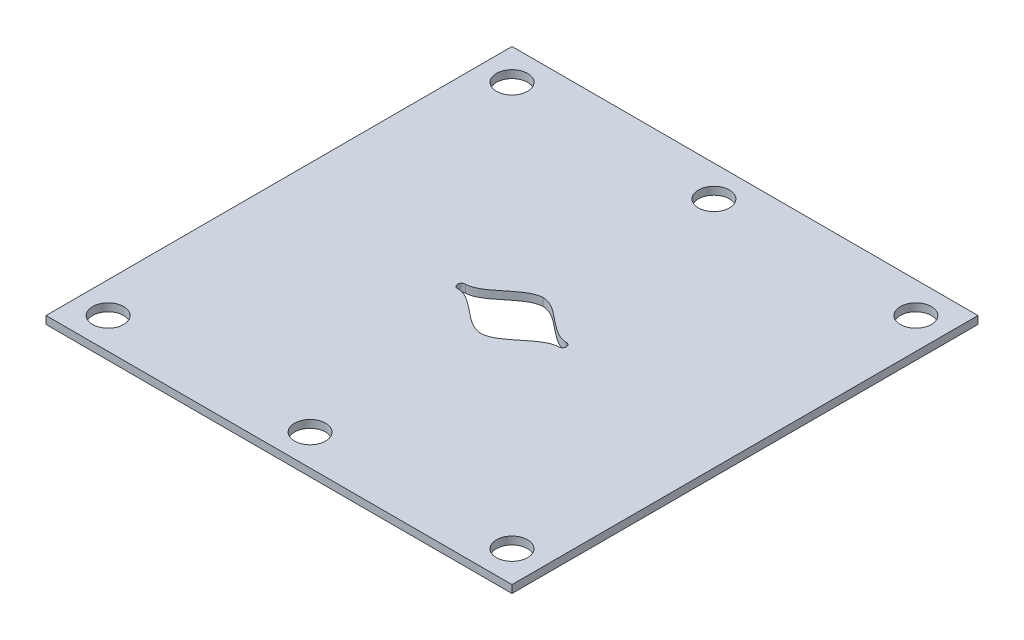
ISO-10303-21;
HEADER;
FILE_DESCRIPTION(('STEP AP214'),'2;1');
FILE_NAME('part.step','',(''),(''),'','','');
FILE_SCHEMA(('AUTOMOTIVE_DESIGN { 1 0 10303 214 1 1 1 1 }'));
ENDSEC;
DATA;
#1=APPLICATION_CONTEXT('core data for automotive mechanical design processes');
#2=APPLICATION_PROTOCOL_DEFINITION('international standard','automotive_design',2000,#1);
#3=PRODUCT_CONTEXT('',#1,'mechanical');
#4=PRODUCT('Part','Part','',(#3));
#5=PRODUCT_RELATED_PRODUCT_CATEGORY('part','',(#4));
#6=PRODUCT_DEFINITION_FORMATION('','',#4);
#7=PRODUCT_DEFINITION_CONTEXT('part definition',#1,'design');
#8=PRODUCT_DEFINITION('design','',#6,#7);
#9=PRODUCT_DEFINITION_SHAPE('','',#8);
#10=(LENGTH_UNIT() NAMED_UNIT(*) SI_UNIT(.MILLI.,.METRE.));
#11=(NAMED_UNIT(*) PLANE_ANGLE_UNIT() SI_UNIT($,.RADIAN.));
#12=(NAMED_UNIT(*) SI_UNIT($,.STERADIAN.) SOLID_ANGLE_UNIT());
#13=UNCERTAINTY_MEASURE_WITH_UNIT(LENGTH_MEASURE(1.E-05),#10,'distance_accuracy_value','');
#14=(GEOMETRIC_REPRESENTATION_CONTEXT(3) GLOBAL_UNCERTAINTY_ASSIGNED_CONTEXT((#13)) GLOBAL_UNIT_ASSIGNED_CONTEXT((#10,
#11,#12)) REPRESENTATION_CONTEXT('',''));
#15=CARTESIAN_POINT('',(0.,0.,0.));
#16=DIRECTION('',(0.,0.,1.));
#17=DIRECTION('',(1.,0.,0.));
#18=AXIS2_PLACEMENT_3D('',#15,#16,#17);
#19=CARTESIAN_POINT('',(-30.,1.,30.));
#20=DIRECTION('',(1.,0.,0.));
#21=DIRECTION('',(0.,0.,-1.));
#22=AXIS2_PLACEMENT_3D('',#19,#20,#21);
#23=PLANE('',#22);
#24=DIRECTION('',(0.,0.,1.));
#25=VECTOR('',#24,1.);
#26=CARTESIAN_POINT('',(-30.,0.,30.));
#27=LINE('',#26,#25);
#28=CARTESIAN_POINT('',(-30.,0.,-30.));
#29=VERTEX_POINT('',#28);
#30=CARTESIAN_POINT('',(-30.,0.,30.));
#31=VERTEX_POINT('',#30);
#32=EDGE_CURVE('E202',#29,#31,#27,.T.);
#33=ORIENTED_EDGE('',*,*,#32,.T.);
#34=DIRECTION('',(0.,-1.,0.));
#35=VECTOR('',#34,1.);
#36=CARTESIAN_POINT('',(-30.,1.,30.));
#37=LINE('',#36,#35);
#38=CARTESIAN_POINT('',(-30.,1.,30.));
#39=VERTEX_POINT('',#38);
#40=EDGE_CURVE('E229',#39,#31,#37,.T.);
#41=ORIENTED_EDGE('',*,*,#40,.F.);
#42=DIRECTION('',(0.,0.,1.));
#43=VECTOR('',#42,1.);
#44=CARTESIAN_POINT('',(-30.,1.,30.));
#45=LINE('',#44,#43);
#46=CARTESIAN_POINT('',(-30.,1.,-30.));
#47=VERTEX_POINT('',#46);
#48=EDGE_CURVE('E203',#47,#39,#45,.T.);
#49=ORIENTED_EDGE('',*,*,#48,.F.);
#50=DIRECTION('',(0.,-1.,0.));
#51=VECTOR('',#50,1.);
#52=CARTESIAN_POINT('',(-30.,1.,-30.));
#53=LINE('',#52,#51);
#54=EDGE_CURVE('E213',#47,#29,#53,.T.);
#55=ORIENTED_EDGE('',*,*,#54,.T.);
#56=EDGE_LOOP('',(#33,#41,#49,#55));
#57=FACE_BOUND('',#56,.T.);
#58=ADVANCED_FACE('F37',(#57),#23,.F.);
#59=CARTESIAN_POINT('',(30.,1.,30.));
#60=DIRECTION('',(0.,0.,-1.));
#61=DIRECTION('',(-1.,0.,0.));
#62=AXIS2_PLACEMENT_3D('',#59,#60,#61);
#63=PLANE('',#62);
#64=DIRECTION('',(1.,0.,0.));
#65=VECTOR('',#64,1.);
#66=CARTESIAN_POINT('',(30.,0.,30.));
#67=LINE('',#66,#65);
#68=CARTESIAN_POINT('',(30.,0.,30.));
#69=VERTEX_POINT('',#68);
#70=EDGE_CURVE('E216',#31,#69,#67,.T.);
#71=ORIENTED_EDGE('',*,*,#70,.T.);
#72=DIRECTION('',(0.,-1.,0.));
#73=VECTOR('',#72,1.);
#74=CARTESIAN_POINT('',(30.,1.,30.));
#75=LINE('',#74,#73);
#76=CARTESIAN_POINT('',(30.,1.,30.));
#77=VERTEX_POINT('',#76);
#78=EDGE_CURVE('E226',#77,#69,#75,.T.);
#79=ORIENTED_EDGE('',*,*,#78,.F.);
#80=DIRECTION('',(1.,0.,0.));
#81=VECTOR('',#80,1.);
#82=CARTESIAN_POINT('',(30.,1.,30.));
#83=LINE('',#82,#81);
#84=EDGE_CURVE('E206',#39,#77,#83,.T.);
#85=ORIENTED_EDGE('',*,*,#84,.F.);
#86=ORIENTED_EDGE('',*,*,#40,.T.);
#87=EDGE_LOOP('',(#71,#79,#85,#86));
#88=FACE_BOUND('',#87,.T.);
#89=ADVANCED_FACE('F346',(#88),#63,.F.);
#90=CARTESIAN_POINT('',(30.,1.,30.));
#91=DIRECTION('',(-1.,0.,0.));
#92=DIRECTION('',(0.,0.,1.));
#93=AXIS2_PLACEMENT_3D('',#90,#91,#92);
#94=PLANE('',#93);
#95=DIRECTION('',(0.,0.,-1.));
#96=VECTOR('',#95,1.);
#97=CARTESIAN_POINT('',(30.,0.,30.));
#98=LINE('',#97,#96);
#99=CARTESIAN_POINT('',(30.,0.,-30.));
#100=VERTEX_POINT('',#99);
#101=EDGE_CURVE('E218',#69,#100,#98,.T.);
#102=ORIENTED_EDGE('',*,*,#101,.T.);
#103=DIRECTION('',(0.,-1.,0.));
#104=VECTOR('',#103,1.);
#105=CARTESIAN_POINT('',(30.,1.,-30.));
#106=LINE('',#105,#104);
#107=CARTESIAN_POINT('',(30.,1.,-30.));
#108=VERTEX_POINT('',#107);
#109=EDGE_CURVE('E223',#108,#100,#106,.T.);
#110=ORIENTED_EDGE('',*,*,#109,.F.);
#111=DIRECTION('',(0.,0.,-1.));
#112=VECTOR('',#111,1.);
#113=CARTESIAN_POINT('',(30.,1.,30.));
#114=LINE('',#113,#112);
#115=EDGE_CURVE('E209',#77,#108,#114,.T.);
#116=ORIENTED_EDGE('',*,*,#115,.F.);
#117=ORIENTED_EDGE('',*,*,#78,.T.);
#118=EDGE_LOOP('',(#102,#110,#116,#117));
#119=FACE_BOUND('',#118,.T.);
#120=ADVANCED_FACE('F343',(#119),#94,.F.);
#121=CARTESIAN_POINT('',(30.,1.,-30.));
#122=DIRECTION('',(0.,0.,1.));
#123=DIRECTION('',(1.,0.,0.));
#124=AXIS2_PLACEMENT_3D('',#121,#122,#123);
#125=PLANE('',#124);
#126=DIRECTION('',(-1.,0.,0.));
#127=VECTOR('',#126,1.);
#128=CARTESIAN_POINT('',(30.,0.,-30.));
#129=LINE('',#128,#127);
#130=EDGE_CURVE('E207',#100,#29,#129,.T.);
#131=ORIENTED_EDGE('',*,*,#130,.T.);
#132=ORIENTED_EDGE('',*,*,#54,.F.);
#133=DIRECTION('',(-1.,0.,0.));
#134=VECTOR('',#133,1.);
#135=CARTESIAN_POINT('',(30.,1.,-30.));
#136=LINE('',#135,#134);
#137=EDGE_CURVE('E211',#108,#47,#136,.T.);
#138=ORIENTED_EDGE('',*,*,#137,.F.);
#139=ORIENTED_EDGE('',*,*,#109,.T.);
#140=EDGE_LOOP('',(#131,#132,#138,#139));
#141=FACE_BOUND('',#140,.T.);
#142=ADVANCED_FACE('F338',(#141),#125,.F.);
#143=CARTESIAN_POINT('',(0.,1.,0.));
#144=DIRECTION('',(0.,1.,0.));
#145=DIRECTION('',(0.,0.,1.));
#146=AXIS2_PLACEMENT_3D('',#143,#144,#145);
#147=PLANE('',#146);
#148=CARTESIAN_POINT('',(6.49999999923458,1.,-0.500000000000001));
#149=CARTESIAN_POINT('',(4.3333333326403,1.,-0.499999999997519));
#150=CARTESIAN_POINT('',(2.16666666604602,1.,-4.000004083097));
#151=CARTESIAN_POINT('',(-5.48264814668782E-10,1.,-4.00001323749999));
#152=B_SPLINE_CURVE_WITH_KNOTS('',3,(#148,#149,#150,#151),.UNSPECIFIED.,.F.,.F.,(4,4),
(0.0833333333330379,0.916666666638532),.UNSPECIFIED.);
#153=CARTESIAN_POINT('',(6.4999999993447,1.,-0.500000000000001));
#154=VERTEX_POINT('',#153);
#155=CARTESIAN_POINT('',(-9.14407980757981E-10,1.,-4.00001323749999));
#156=VERTEX_POINT('',#155);
#157=EDGE_CURVE('E53',#154,#156,#152,.T.);
#158=ORIENTED_EDGE('',*,*,#157,.F.);
#159=CARTESIAN_POINT('',(6.4999999993447,1.,0.));
#160=DIRECTION('',(0.,1.,0.));
#161=DIRECTION('',(0.,0.,1.));
#162=AXIS2_PLACEMENT_3D('',#159,#160,#161);
#163=CIRCLE('',#162,0.500000000000001);
#164=CARTESIAN_POINT('',(6.4999999993447,1.,0.500000000000001));
#165=VERTEX_POINT('',#164);
#166=EDGE_CURVE('E152',#165,#154,#163,.T.);
#167=ORIENTED_EDGE('',*,*,#166,.F.);
#168=CARTESIAN_POINT('',(-4.38153172686386E-10,1.,4.00001323749999));
#169=CARTESIAN_POINT('',(2.16666666615613,1.,4.00000408309701));
#170=CARTESIAN_POINT('',(4.33333333275042,1.,0.499999999997519));
#171=CARTESIAN_POINT('',(6.4999999993447,1.,0.500000000000001));
#172=B_SPLINE_CURVE_WITH_KNOTS('',3,(#168,#169,#170,#171),.UNSPECIFIED.,.F.,.F.,(4,4),
(0.0833333333330379,0.916666666638532),.UNSPECIFIED.);
#173=CARTESIAN_POINT('',(-4.38153172686386E-10,1.,4.00001323749999));
#174=VERTEX_POINT('',#173);
#175=EDGE_CURVE('E137',#174,#165,#172,.T.);
#176=ORIENTED_EDGE('',*,*,#175,.F.);
#177=CARTESIAN_POINT('',(-6.50000000018442,1.,0.500000000000001));
#178=CARTESIAN_POINT('',(-4.33333333360233,1.,0.499999999997518));
#179=CARTESIAN_POINT('',(-2.16666666702024,1.,4.00000408305761));
#180=CARTESIAN_POINT('',(-4.38151141389445E-10,1.,4.00001323749999));
#181=B_SPLINE_CURVE_WITH_KNOTS('',3,(#177,#178,#179,#180),.UNSPECIFIED.,.F.,.F.,(4,4),
(0.0833333333330379,0.916666666633843),.UNSPECIFIED.);
#182=CARTESIAN_POINT('',(-6.50000000018442,1.,0.500000000000001));
#183=VERTEX_POINT('',#182);
#184=EDGE_CURVE('E135',#183,#174,#181,.T.);
#185=ORIENTED_EDGE('',*,*,#184,.F.);
#186=CARTESIAN_POINT('',(-6.500000000185,1.,0.));
#187=DIRECTION('',(0.,1.,0.));
#188=DIRECTION('',(0.,0.,-1.));
#189=AXIS2_PLACEMENT_3D('',#186,#187,#188);
#190=CIRCLE('',#189,0.5);
#191=CARTESIAN_POINT('',(-6.50000000000192,1.,-0.5));
#192=VERTEX_POINT('',#191);
#193=EDGE_CURVE('E118',#192,#183,#190,.T.);
#194=ORIENTED_EDGE('',*,*,#193,.F.);
#195=CARTESIAN_POINT('',(-9.14407980757981E-10,1.,-4.00001323749999));
#196=CARTESIAN_POINT('',(-2.16666666727704,1.,-4.00000408234859));
#197=CARTESIAN_POINT('',(-4.33333333363967,1.,-0.499999999997518));
#198=CARTESIAN_POINT('',(-6.5000000000023,1.,-0.5));
#199=B_SPLINE_CURVE_WITH_KNOTS('',3,(#195,#196,#197,#198),.UNSPECIFIED.,.F.,.F.,(4,4),
(0.0833333333330379,0.916666666549435),.UNSPECIFIED.);
#200=EDGE_CURVE('E127',#156,#192,#199,.T.);
#201=ORIENTED_EDGE('',*,*,#200,.F.);
#202=EDGE_LOOP('',(#158,#167,#176,#185,#194,#201));
#203=FACE_BOUND('',#202,.T.);
#204=CARTESIAN_POINT('',(26.,1.,-26.));
#205=DIRECTION('',(0.,1.,0.));
#206=DIRECTION('',(0.,0.,1.));
#207=AXIS2_PLACEMENT_3D('',#204,#205,#206);
#208=CIRCLE('',#207,2.);
#209=CARTESIAN_POINT('',(26.,1.,-24.));
#210=VERTEX_POINT('',#209);
#211=EDGE_CURVE('E160',#210,#210,#208,.T.);
#212=ORIENTED_EDGE('',*,*,#211,.F.);
#213=EDGE_LOOP('',(#212));
#214=FACE_BOUND('',#213,.T.);
#215=CARTESIAN_POINT('',(0.,1.,-26.));
#216=DIRECTION('',(0.,1.,0.));
#217=DIRECTION('',(0.,0.,1.));
#218=AXIS2_PLACEMENT_3D('',#215,#216,#217);
#219=CIRCLE('',#218,2.);
#220=CARTESIAN_POINT('',(0.,1.,-24.));
#221=VERTEX_POINT('',#220);
#222=EDGE_CURVE('E172',#221,#221,#219,.T.);
#223=ORIENTED_EDGE('',*,*,#222,.F.);
#224=EDGE_LOOP('',(#223));
#225=FACE_BOUND('',#224,.T.);
#226=CARTESIAN_POINT('',(-26.,1.,-26.));
#227=DIRECTION('',(0.,1.,0.));
#228=DIRECTION('',(0.,0.,1.));
#229=AXIS2_PLACEMENT_3D('',#226,#227,#228);
#230=CIRCLE('',#229,2.);
#231=CARTESIAN_POINT('',(-26.,1.,-24.));
#232=VERTEX_POINT('',#231);
#233=EDGE_CURVE('E178',#232,#232,#230,.T.);
#234=ORIENTED_EDGE('',*,*,#233,.F.);
#235=EDGE_LOOP('',(#234));
#236=FACE_BOUND('',#235,.T.);
#237=CARTESIAN_POINT('',(0.,1.,26.));
#238=DIRECTION('',(0.,1.,0.));
#239=DIRECTION('',(0.,0.,1.));
#240=AXIS2_PLACEMENT_3D('',#237,#238,#239);
#241=CIRCLE('',#240,2.);
#242=CARTESIAN_POINT('',(0.,1.,28.));
#243=VERTEX_POINT('',#242);
#244=EDGE_CURVE('E184',#243,#243,#241,.T.);
#245=ORIENTED_EDGE('',*,*,#244,.F.);
#246=EDGE_LOOP('',(#245));
#247=FACE_BOUND('',#246,.T.);
#248=CARTESIAN_POINT('',(26.,1.,26.));
#249=DIRECTION('',(0.,1.,0.));
#250=DIRECTION('',(0.,0.,1.));
#251=AXIS2_PLACEMENT_3D('',#248,#249,#250);
#252=CIRCLE('',#251,2.);
#253=CARTESIAN_POINT('',(26.,1.,28.));
#254=VERTEX_POINT('',#253);
#255=EDGE_CURVE('E190',#254,#254,#252,.T.);
#256=ORIENTED_EDGE('',*,*,#255,.F.);
#257=EDGE_LOOP('',(#256));
#258=FACE_BOUND('',#257,.T.);
#259=CARTESIAN_POINT('',(-26.,1.,26.));
#260=DIRECTION('',(0.,1.,0.));
#261=DIRECTION('',(0.,0.,1.));
#262=AXIS2_PLACEMENT_3D('',#259,#260,#261);
#263=CIRCLE('',#262,2.);
#264=CARTESIAN_POINT('',(-26.,1.,28.));
#265=VERTEX_POINT('',#264);
#266=EDGE_CURVE('E196',#265,#265,#263,.T.);
#267=ORIENTED_EDGE('',*,*,#266,.F.);
#268=EDGE_LOOP('',(#267));
#269=FACE_BOUND('',#268,.T.);
#270=ORIENTED_EDGE('',*,*,#48,.T.);
#271=ORIENTED_EDGE('',*,*,#84,.T.);
#272=ORIENTED_EDGE('',*,*,#115,.T.);
#273=ORIENTED_EDGE('',*,*,#137,.T.);
#274=EDGE_LOOP('',(#270,#271,#272,#273));
#275=FACE_BOUND('',#274,.T.);
#276=ADVANCED_FACE('F131',(#203,#214,#225,#236,#247,#258,#269,#275),#147,.T.);
#277=CARTESIAN_POINT('',(0.,0.,0.));
#278=DIRECTION('',(0.,1.,0.));
#279=DIRECTION('',(0.,0.,1.));
#280=AXIS2_PLACEMENT_3D('',#277,#278,#279);
#281=PLANE('',#280);
#282=CARTESIAN_POINT('',(6.4999999993447,0.,0.));
#283=DIRECTION('',(0.,1.,0.));
#284=DIRECTION('',(0.,0.,1.));
#285=AXIS2_PLACEMENT_3D('',#282,#283,#284);
#286=CIRCLE('',#285,0.500000000000001);
#287=CARTESIAN_POINT('',(6.4999999993447,0.,0.500000000000001));
#288=VERTEX_POINT('',#287);
#289=CARTESIAN_POINT('',(6.4999999993447,0.,-0.500000000000001));
#290=VERTEX_POINT('',#289);
#291=EDGE_CURVE('E46',#288,#290,#286,.T.);
#292=ORIENTED_EDGE('',*,*,#291,.T.);
#293=CARTESIAN_POINT('',(6.49999999923458,0.,-0.500000000000001));
#294=CARTESIAN_POINT('',(4.3333333326403,0.,-0.499999999997519));
#295=CARTESIAN_POINT('',(2.16666666604602,0.,-4.000004083097));
#296=CARTESIAN_POINT('',(-5.48264814668782E-10,0.,-4.00001323749999));
#297=B_SPLINE_CURVE_WITH_KNOTS('',3,(#293,#294,#295,#296),.UNSPECIFIED.,.F.,.F.,(4,4),
(0.0833333333330379,0.916666666638532),.UNSPECIFIED.);
#298=CARTESIAN_POINT('',(-9.14407980757981E-10,0.,-4.00001323749999));
#299=VERTEX_POINT('',#298);
#300=EDGE_CURVE('E11',#290,#299,#297,.T.);
#301=ORIENTED_EDGE('',*,*,#300,.T.);
#302=CARTESIAN_POINT('',(-9.14407980757981E-10,0.,-4.00001323749999));
#303=CARTESIAN_POINT('',(-2.16666666727704,0.,-4.00000408234859));
#304=CARTESIAN_POINT('',(-4.33333333363967,0.,-0.499999999997518));
#305=CARTESIAN_POINT('',(-6.5000000000023,0.,-0.5));
#306=B_SPLINE_CURVE_WITH_KNOTS('',3,(#302,#303,#304,#305),.UNSPECIFIED.,.F.,.F.,(4,4),
(0.0833333333330379,0.916666666549435),.UNSPECIFIED.);
#307=CARTESIAN_POINT('',(-6.5000000000023,0.,-0.5));
#308=VERTEX_POINT('',#307);
#309=EDGE_CURVE('E232',#299,#308,#306,.T.);
#310=ORIENTED_EDGE('',*,*,#309,.T.);
#311=CARTESIAN_POINT('',(-6.500000000185,0.,0.));
#312=DIRECTION('',(0.,1.,0.));
#313=DIRECTION('',(0.,0.,1.));
#314=AXIS2_PLACEMENT_3D('',#311,#312,#313);
#315=CIRCLE('',#314,0.5);
#316=CARTESIAN_POINT('',(-6.50000000018442,0.,0.500000000000001));
#317=VERTEX_POINT('',#316);
#318=EDGE_CURVE('E121',#308,#317,#315,.T.);
#319=ORIENTED_EDGE('',*,*,#318,.T.);
#320=CARTESIAN_POINT('',(-6.50000000018442,0.,0.500000000000001));
#321=CARTESIAN_POINT('',(-4.33333333360233,0.,0.499999999997518));
#322=CARTESIAN_POINT('',(-2.16666666702024,0.,4.00000408305761));
#323=CARTESIAN_POINT('',(-4.38151141389445E-10,0.,4.00001323749999));
#324=B_SPLINE_CURVE_WITH_KNOTS('',3,(#320,#321,#322,#323),.UNSPECIFIED.,.F.,.F.,(4,4),
(0.0833333333330379,0.916666666633843),.UNSPECIFIED.);
#325=CARTESIAN_POINT('',(-4.38153172686386E-10,0.,4.00001323749999));
#326=VERTEX_POINT('',#325);
#327=EDGE_CURVE('E240',#317,#326,#324,.T.);
#328=ORIENTED_EDGE('',*,*,#327,.T.);
#329=CARTESIAN_POINT('',(-4.38153172686386E-10,0.,4.00001323749999));
#330=CARTESIAN_POINT('',(2.16666666615613,0.,4.00000408309701));
#331=CARTESIAN_POINT('',(4.33333333275042,0.,0.499999999997519));
#332=CARTESIAN_POINT('',(6.4999999993447,0.,0.500000000000001));
#333=B_SPLINE_CURVE_WITH_KNOTS('',3,(#329,#330,#331,#332),.UNSPECIFIED.,.F.,.F.,(4,4),
(0.0833333333330379,0.916666666638532),.UNSPECIFIED.);
#334=EDGE_CURVE('E245',#326,#288,#333,.T.);
#335=ORIENTED_EDGE('',*,*,#334,.T.);
#336=EDGE_LOOP('',(#292,#301,#310,#319,#328,#335));
#337=FACE_BOUND('',#336,.T.);
#338=CARTESIAN_POINT('',(26.,0.,-26.));
#339=DIRECTION('',(0.,1.,0.));
#340=DIRECTION('',(0.,0.,1.));
#341=AXIS2_PLACEMENT_3D('',#338,#339,#340);
#342=CIRCLE('',#341,2.);
#343=CARTESIAN_POINT('',(26.,0.,-24.));
#344=VERTEX_POINT('',#343);
#345=EDGE_CURVE('E169',#344,#344,#342,.T.);
#346=ORIENTED_EDGE('',*,*,#345,.T.);
#347=EDGE_LOOP('',(#346));
#348=FACE_BOUND('',#347,.T.);
#349=CARTESIAN_POINT('',(0.,0.,-26.));
#350=DIRECTION('',(0.,1.,0.));
#351=DIRECTION('',(0.,0.,1.));
#352=AXIS2_PLACEMENT_3D('',#349,#350,#351);
#353=CIRCLE('',#352,2.);
#354=CARTESIAN_POINT('',(0.,0.,-24.));
#355=VERTEX_POINT('',#354);
#356=EDGE_CURVE('E175',#355,#355,#353,.T.);
#357=ORIENTED_EDGE('',*,*,#356,.T.);
#358=EDGE_LOOP('',(#357));
#359=FACE_BOUND('',#358,.T.);
#360=CARTESIAN_POINT('',(-26.,0.,-26.));
#361=DIRECTION('',(0.,1.,0.));
#362=DIRECTION('',(0.,0.,1.));
#363=AXIS2_PLACEMENT_3D('',#360,#361,#362);
#364=CIRCLE('',#363,2.);
#365=CARTESIAN_POINT('',(-26.,0.,-24.));
#366=VERTEX_POINT('',#365);
#367=EDGE_CURVE('E181',#366,#366,#364,.T.);
#368=ORIENTED_EDGE('',*,*,#367,.T.);
#369=EDGE_LOOP('',(#368));
#370=FACE_BOUND('',#369,.T.);
#371=CARTESIAN_POINT('',(0.,0.,26.));
#372=DIRECTION('',(0.,1.,0.));
#373=DIRECTION('',(0.,0.,1.));
#374=AXIS2_PLACEMENT_3D('',#371,#372,#373);
#375=CIRCLE('',#374,2.);
#376=CARTESIAN_POINT('',(0.,0.,28.));
#377=VERTEX_POINT('',#376);
#378=EDGE_CURVE('E187',#377,#377,#375,.T.);
#379=ORIENTED_EDGE('',*,*,#378,.T.);
#380=EDGE_LOOP('',(#379));
#381=FACE_BOUND('',#380,.T.);
#382=CARTESIAN_POINT('',(26.,0.,26.));
#383=DIRECTION('',(0.,1.,0.));
#384=DIRECTION('',(0.,0.,1.));
#385=AXIS2_PLACEMENT_3D('',#382,#383,#384);
#386=CIRCLE('',#385,2.);
#387=CARTESIAN_POINT('',(26.,0.,28.));
#388=VERTEX_POINT('',#387);
#389=EDGE_CURVE('E193',#388,#388,#386,.T.);
#390=ORIENTED_EDGE('',*,*,#389,.T.);
#391=EDGE_LOOP('',(#390));
#392=FACE_BOUND('',#391,.T.);
#393=CARTESIAN_POINT('',(-26.,0.,26.));
#394=DIRECTION('',(0.,1.,0.));
#395=DIRECTION('',(0.,0.,1.));
#396=AXIS2_PLACEMENT_3D('',#393,#394,#395);
#397=CIRCLE('',#396,2.);
#398=CARTESIAN_POINT('',(-26.,0.,28.));
#399=VERTEX_POINT('',#398);
#400=EDGE_CURVE('E199',#399,#399,#397,.T.);
#401=ORIENTED_EDGE('',*,*,#400,.T.);
#402=EDGE_LOOP('',(#401));
#403=FACE_BOUND('',#402,.T.);
#404=ORIENTED_EDGE('',*,*,#32,.F.);
#405=ORIENTED_EDGE('',*,*,#130,.F.);
#406=ORIENTED_EDGE('',*,*,#101,.F.);
#407=ORIENTED_EDGE('',*,*,#70,.F.);
#408=EDGE_LOOP('',(#404,#405,#406,#407));
#409=FACE_BOUND('',#408,.T.);
#410=ADVANCED_FACE('F257',(#337,#348,#359,#370,#381,#392,#403,#409),#281,.F.);
#411=CARTESIAN_POINT('',(-26.,1.,26.));
#412=DIRECTION('',(0.,1.,0.));
#413=DIRECTION('',(0.,0.,1.));
#414=AXIS2_PLACEMENT_3D('',#411,#412,#413);
#415=CYLINDRICAL_SURFACE('',#414,2.);
#416=ORIENTED_EDGE('',*,*,#400,.F.);
#417=EDGE_LOOP('',(#416));
#418=FACE_BOUND('',#417,.T.);
#419=ORIENTED_EDGE('',*,*,#266,.T.);
#420=EDGE_LOOP('',(#419));
#421=FACE_BOUND('',#420,.T.);
#422=ADVANCED_FACE('F331',(#418,#421),#415,.F.);
#423=CARTESIAN_POINT('',(26.,1.,26.));
#424=DIRECTION('',(0.,1.,0.));
#425=DIRECTION('',(0.,0.,1.));
#426=AXIS2_PLACEMENT_3D('',#423,#424,#425);
#427=CYLINDRICAL_SURFACE('',#426,2.);
#428=ORIENTED_EDGE('',*,*,#389,.F.);
#429=EDGE_LOOP('',(#428));
#430=FACE_BOUND('',#429,.T.);
#431=ORIENTED_EDGE('',*,*,#255,.T.);
#432=EDGE_LOOP('',(#431));
#433=FACE_BOUND('',#432,.T.);
#434=ADVANCED_FACE('F327',(#430,#433),#427,.F.);
#435=CARTESIAN_POINT('',(0.,1.,26.));
#436=DIRECTION('',(0.,1.,0.));
#437=DIRECTION('',(0.,0.,1.));
#438=AXIS2_PLACEMENT_3D('',#435,#436,#437);
#439=CYLINDRICAL_SURFACE('',#438,2.);
#440=ORIENTED_EDGE('',*,*,#378,.F.);
#441=EDGE_LOOP('',(#440));
#442=FACE_BOUND('',#441,.T.);
#443=ORIENTED_EDGE('',*,*,#244,.T.);
#444=EDGE_LOOP('',(#443));
#445=FACE_BOUND('',#444,.T.);
#446=ADVANCED_FACE('F323',(#442,#445),#439,.F.);
#447=CARTESIAN_POINT('',(-26.,1.,-26.));
#448=DIRECTION('',(0.,1.,0.));
#449=DIRECTION('',(0.,0.,1.));
#450=AXIS2_PLACEMENT_3D('',#447,#448,#449);
#451=CYLINDRICAL_SURFACE('',#450,2.);
#452=ORIENTED_EDGE('',*,*,#367,.F.);
#453=EDGE_LOOP('',(#452));
#454=FACE_BOUND('',#453,.T.);
#455=ORIENTED_EDGE('',*,*,#233,.T.);
#456=EDGE_LOOP('',(#455));
#457=FACE_BOUND('',#456,.T.);
#458=ADVANCED_FACE('F319',(#454,#457),#451,.F.);
#459=CARTESIAN_POINT('',(0.,1.,-26.));
#460=DIRECTION('',(0.,1.,0.));
#461=DIRECTION('',(0.,0.,1.));
#462=AXIS2_PLACEMENT_3D('',#459,#460,#461);
#463=CYLINDRICAL_SURFACE('',#462,2.);
#464=ORIENTED_EDGE('',*,*,#356,.F.);
#465=EDGE_LOOP('',(#464));
#466=FACE_BOUND('',#465,.T.);
#467=ORIENTED_EDGE('',*,*,#222,.T.);
#468=EDGE_LOOP('',(#467));
#469=FACE_BOUND('',#468,.T.);
#470=ADVANCED_FACE('F315',(#466,#469),#463,.F.);
#471=CARTESIAN_POINT('',(26.,1.,-26.));
#472=DIRECTION('',(0.,1.,0.));
#473=DIRECTION('',(0.,0.,1.));
#474=AXIS2_PLACEMENT_3D('',#471,#472,#473);
#475=CYLINDRICAL_SURFACE('',#474,2.);
#476=ORIENTED_EDGE('',*,*,#345,.F.);
#477=EDGE_LOOP('',(#476));
#478=FACE_BOUND('',#477,.T.);
#479=ORIENTED_EDGE('',*,*,#211,.T.);
#480=EDGE_LOOP('',(#479));
#481=FACE_BOUND('',#480,.T.);
#482=ADVANCED_FACE('F312',(#478,#481),#475,.F.);
#483=CARTESIAN_POINT('',(6.49999999923458,-9.,-0.500000000000001));
#484=CARTESIAN_POINT('',(4.3333333326403,-9.,-0.499999999997519));
#485=CARTESIAN_POINT('',(2.16666666604602,-9.,-4.000004083097));
#486=CARTESIAN_POINT('',(-5.48264814668782E-10,-9.,-4.00001323749999));
#487=B_SPLINE_CURVE_WITH_KNOTS('',3,(#483,#484,#485,#486),.UNSPECIFIED.,.F.,.F.,(4,4),
(0.0833333333330379,0.916666666638532),.UNSPECIFIED.);
#488=DIRECTION('',(0.,1.,0.));
#489=VECTOR('',#488,1.);
#490=SURFACE_OF_LINEAR_EXTRUSION('',#487,#489);
#491=DIRECTION('',(0.,1.,0.));
#492=VECTOR('',#491,1.);
#493=CARTESIAN_POINT('',(6.4999999993447,-9.,-0.500000000000001));
#494=LINE('',#493,#492);
#495=EDGE_CURVE('E158',#290,#154,#494,.T.);
#496=ORIENTED_EDGE('',*,*,#495,.T.);
#497=ORIENTED_EDGE('',*,*,#157,.T.);
#498=DIRECTION('',(0.,1.,0.));
#499=VECTOR('',#498,1.);
#500=CARTESIAN_POINT('',(-9.14407980757981E-10,-9.,-4.00001323749999));
#501=LINE('',#500,#499);
#502=EDGE_CURVE('E124',#299,#156,#501,.T.);
#503=ORIENTED_EDGE('',*,*,#502,.F.);
#504=ORIENTED_EDGE('',*,*,#300,.F.);
#505=EDGE_LOOP('',(#496,#497,#503,#504));
#506=FACE_BOUND('',#505,.T.);
#507=ADVANCED_FACE('F296',(#506),#490,.F.);
#508=CARTESIAN_POINT('',(6.4999999993447,-9.,0.));
#509=DIRECTION('',(0.,1.,0.));
#510=DIRECTION('',(0.,0.,1.));
#511=AXIS2_PLACEMENT_3D('',#508,#509,#510);
#512=CYLINDRICAL_SURFACE('',#511,0.500000000000001);
#513=DIRECTION('',(0.,1.,0.));
#514=VECTOR('',#513,1.);
#515=CARTESIAN_POINT('',(6.4999999993447,-9.,0.500000000000001));
#516=LINE('',#515,#514);
#517=EDGE_CURVE('E161',#288,#165,#516,.T.);
#518=ORIENTED_EDGE('',*,*,#517,.T.);
#519=ORIENTED_EDGE('',*,*,#166,.T.);
#520=ORIENTED_EDGE('',*,*,#495,.F.);
#521=ORIENTED_EDGE('',*,*,#291,.F.);
#522=EDGE_LOOP('',(#518,#519,#520,#521));
#523=FACE_BOUND('',#522,.T.);
#524=ADVANCED_FACE('F262',(#523),#512,.F.);
#525=CARTESIAN_POINT('',(-4.38153172686386E-10,-9.,4.00001323749999));
#526=CARTESIAN_POINT('',(2.16666666615613,-9.,4.00000408309701));
#527=CARTESIAN_POINT('',(4.33333333275042,-9.,0.499999999997519));
#528=CARTESIAN_POINT('',(6.4999999993447,-9.,0.500000000000001));
#529=B_SPLINE_CURVE_WITH_KNOTS('',3,(#525,#526,#527,#528),.UNSPECIFIED.,.F.,.F.,(4,4),
(0.0833333333330379,0.916666666638532),.UNSPECIFIED.);
#530=DIRECTION('',(0.,1.,0.));
#531=VECTOR('',#530,1.);
#532=SURFACE_OF_LINEAR_EXTRUSION('',#529,#531);
#533=DIRECTION('',(0.,1.,0.));
#534=VECTOR('',#533,1.);
#535=CARTESIAN_POINT('',(-4.38153172686386E-10,-9.,4.00001323749999));
#536=LINE('',#535,#534);
#537=EDGE_CURVE('E163',#326,#174,#536,.T.);
#538=ORIENTED_EDGE('',*,*,#537,.T.);
#539=ORIENTED_EDGE('',*,*,#175,.T.);
#540=ORIENTED_EDGE('',*,*,#517,.F.);
#541=ORIENTED_EDGE('',*,*,#334,.F.);
#542=EDGE_LOOP('',(#538,#539,#540,#541));
#543=FACE_BOUND('',#542,.T.);
#544=ADVANCED_FACE('F264',(#543),#532,.F.);
#545=CARTESIAN_POINT('',(-6.50000000018442,-9.,0.500000000000001));
#546=CARTESIAN_POINT('',(-4.33333333360233,-9.,0.499999999997518));
#547=CARTESIAN_POINT('',(-2.16666666702024,-9.,4.00000408305761));
#548=CARTESIAN_POINT('',(-4.38151141389445E-10,-9.,4.00001323749999));
#549=B_SPLINE_CURVE_WITH_KNOTS('',3,(#545,#546,#547,#548),.UNSPECIFIED.,.F.,.F.,(4,4),
(0.0833333333330379,0.916666666633843),.UNSPECIFIED.);
#550=DIRECTION('',(0.,1.,0.));
#551=VECTOR('',#550,1.);
#552=SURFACE_OF_LINEAR_EXTRUSION('',#549,#551);
#553=DIRECTION('',(0.,1.,0.));
#554=VECTOR('',#553,1.);
#555=CARTESIAN_POINT('',(-6.50000000018442,-9.,0.500000000000001));
#556=LINE('',#555,#554);
#557=EDGE_CURVE('E123',#317,#183,#556,.T.);
#558=ORIENTED_EDGE('',*,*,#557,.T.);
#559=ORIENTED_EDGE('',*,*,#184,.T.);
#560=ORIENTED_EDGE('',*,*,#537,.F.);
#561=ORIENTED_EDGE('',*,*,#327,.F.);
#562=EDGE_LOOP('',(#558,#559,#560,#561));
#563=FACE_BOUND('',#562,.T.);
#564=ADVANCED_FACE('F288',(#563),#552,.F.);
#565=CARTESIAN_POINT('',(-6.500000000185,-9.,0.));
#566=DIRECTION('',(0.,1.,0.));
#567=DIRECTION('',(0.,0.,1.));
#568=AXIS2_PLACEMENT_3D('',#565,#566,#567);
#569=CYLINDRICAL_SURFACE('',#568,0.5);
#570=DIRECTION('',(0.,1.,0.));
#571=VECTOR('',#570,1.);
#572=CARTESIAN_POINT('',(-6.50000000000192,-9.,-0.5));
#573=LINE('',#572,#571);
#574=EDGE_CURVE('E61',#308,#192,#573,.T.);
#575=ORIENTED_EDGE('',*,*,#574,.T.);
#576=ORIENTED_EDGE('',*,*,#193,.T.);
#577=ORIENTED_EDGE('',*,*,#557,.F.);
#578=ORIENTED_EDGE('',*,*,#318,.F.);
#579=EDGE_LOOP('',(#575,#576,#577,#578));
#580=FACE_BOUND('',#579,.T.);
#581=ADVANCED_FACE('F115',(#580),#569,.F.);
#582=CARTESIAN_POINT('',(-9.14407980757981E-10,-9.,-4.00001323749999));
#583=CARTESIAN_POINT('',(-2.16666666727704,-9.,-4.00000408234859));
#584=CARTESIAN_POINT('',(-4.33333333363967,-9.,-0.499999999997518));
#585=CARTESIAN_POINT('',(-6.5000000000023,-9.,-0.5));
#586=B_SPLINE_CURVE_WITH_KNOTS('',3,(#582,#583,#584,#585),.UNSPECIFIED.,.F.,.F.,(4,4),
(0.0833333333330379,0.916666666549435),.UNSPECIFIED.);
#587=DIRECTION('',(0.,1.,0.));
#588=VECTOR('',#587,1.);
#589=SURFACE_OF_LINEAR_EXTRUSION('',#586,#588);
#590=ORIENTED_EDGE('',*,*,#502,.T.);
#591=ORIENTED_EDGE('',*,*,#200,.T.);
#592=ORIENTED_EDGE('',*,*,#574,.F.);
#593=ORIENTED_EDGE('',*,*,#309,.F.);
#594=EDGE_LOOP('',(#590,#591,#592,#593));
#595=FACE_BOUND('',#594,.T.);
#596=ADVANCED_FACE('F128',(#595),#589,.F.);
#597=CLOSED_SHELL('',(#58,#89,#120,#142,#276,#410,#422,#434,#446,#458,#470,#482,#507,#524,#544,
#564,#581,#596));
#598=MANIFOLD_SOLID_BREP('B2',#597);
#599=ADVANCED_BREP_SHAPE_REPRESENTATION('',(#18,#598),#14);
#600=SHAPE_DEFINITION_REPRESENTATION(#9,#599);
ENDSEC;
END-ISO-10303-21;
